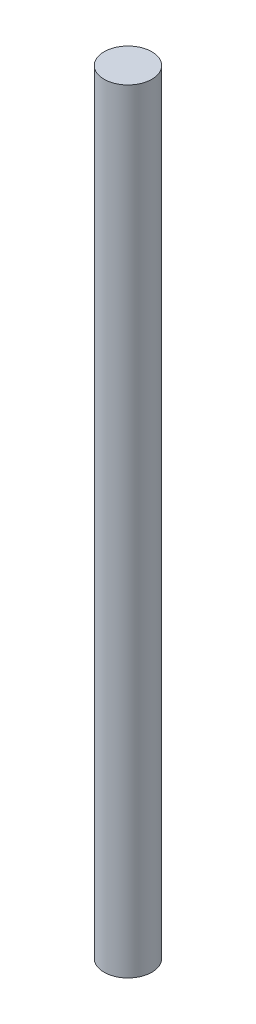
ISO-10303-21;
HEADER;
FILE_DESCRIPTION(('STEP AP214'),'2;1');
FILE_NAME('part.step','',(''),(''),'','','');
FILE_SCHEMA(('AUTOMOTIVE_DESIGN { 1 0 10303 214 1 1 1 1 }'));
ENDSEC;
DATA;
#1=APPLICATION_CONTEXT('core data for automotive mechanical design processes');
#2=APPLICATION_PROTOCOL_DEFINITION('international standard','automotive_design',2000,#1);
#3=PRODUCT_CONTEXT('',#1,'mechanical');
#4=PRODUCT('Part','Part','',(#3));
#5=PRODUCT_RELATED_PRODUCT_CATEGORY('part','',(#4));
#6=PRODUCT_DEFINITION_FORMATION('','',#4);
#7=PRODUCT_DEFINITION_CONTEXT('part definition',#1,'design');
#8=PRODUCT_DEFINITION('design','',#6,#7);
#9=PRODUCT_DEFINITION_SHAPE('','',#8);
#10=(LENGTH_UNIT() NAMED_UNIT(*) SI_UNIT(.MILLI.,.METRE.));
#11=(NAMED_UNIT(*) PLANE_ANGLE_UNIT() SI_UNIT($,.RADIAN.));
#12=(NAMED_UNIT(*) SI_UNIT($,.STERADIAN.) SOLID_ANGLE_UNIT());
#13=UNCERTAINTY_MEASURE_WITH_UNIT(LENGTH_MEASURE(1.E-05),#10,'distance_accuracy_value','');
#14=(GEOMETRIC_REPRESENTATION_CONTEXT(3) GLOBAL_UNCERTAINTY_ASSIGNED_CONTEXT((#13)) GLOBAL_UNIT_ASSIGNED_CONTEXT((#10,
#11,#12)) REPRESENTATION_CONTEXT('',''));
#15=CARTESIAN_POINT('',(0.,0.,0.));
#16=DIRECTION('',(0.,0.,1.));
#17=DIRECTION('',(1.,0.,0.));
#18=AXIS2_PLACEMENT_3D('',#15,#16,#17);
#19=CARTESIAN_POINT('',(0.,180.,0.));
#20=DIRECTION('',(0.,-1.,0.));
#21=DIRECTION('',(0.,0.,-1.));
#22=AXIS2_PLACEMENT_3D('',#19,#20,#21);
#23=CYLINDRICAL_SURFACE('',#22,5.55625);
#24=CARTESIAN_POINT('',(0.,180.,0.));
#25=DIRECTION('',(0.,1.,0.));
#26=DIRECTION('',(0.,0.,1.));
#27=AXIS2_PLACEMENT_3D('',#24,#25,#26);
#28=CIRCLE('',#27,5.55625);
#29=CARTESIAN_POINT('',(0.,180.,5.55625));
#30=VERTEX_POINT('',#29);
#31=EDGE_CURVE('E10',#30,#30,#28,.T.);
#32=ORIENTED_EDGE('',*,*,#31,.F.);
#33=EDGE_LOOP('',(#32));
#34=FACE_BOUND('',#33,.T.);
#35=CARTESIAN_POINT('',(0.,0.,0.));
#36=DIRECTION('',(0.,1.,0.));
#37=DIRECTION('',(0.,0.,1.));
#38=AXIS2_PLACEMENT_3D('',#35,#36,#37);
#39=CIRCLE('',#38,5.55625);
#40=CARTESIAN_POINT('',(0.,0.,5.55625));
#41=VERTEX_POINT('',#40);
#42=EDGE_CURVE('E46',#41,#41,#39,.T.);
#43=ORIENTED_EDGE('',*,*,#42,.T.);
#44=EDGE_LOOP('',(#43));
#45=FACE_BOUND('',#44,.T.);
#46=ADVANCED_FACE('F43',(#34,#45),#23,.T.);
#47=CARTESIAN_POINT('',(0.,180.,0.));
#48=DIRECTION('',(0.,1.,0.));
#49=DIRECTION('',(0.,0.,1.));
#50=AXIS2_PLACEMENT_3D('',#47,#48,#49);
#51=PLANE('',#50);
#52=ORIENTED_EDGE('',*,*,#31,.T.);
#53=EDGE_LOOP('',(#52));
#54=FACE_BOUND('',#53,.T.);
#55=ADVANCED_FACE('F60',(#54),#51,.T.);
#56=CARTESIAN_POINT('',(0.,0.,0.));
#57=DIRECTION('',(0.,1.,0.));
#58=DIRECTION('',(0.,0.,1.));
#59=AXIS2_PLACEMENT_3D('',#56,#57,#58);
#60=PLANE('',#59);
#61=ORIENTED_EDGE('',*,*,#42,.F.);
#62=EDGE_LOOP('',(#61));
#63=FACE_BOUND('',#62,.T.);
#64=ADVANCED_FACE('F58',(#63),#60,.F.);
#65=CLOSED_SHELL('',(#46,#55,#64));
#66=MANIFOLD_SOLID_BREP('B2',#65);
#67=ADVANCED_BREP_SHAPE_REPRESENTATION('',(#18,#66),#14);
#68=SHAPE_DEFINITION_REPRESENTATION(#9,#67);
ENDSEC;
END-ISO-10303-21;
